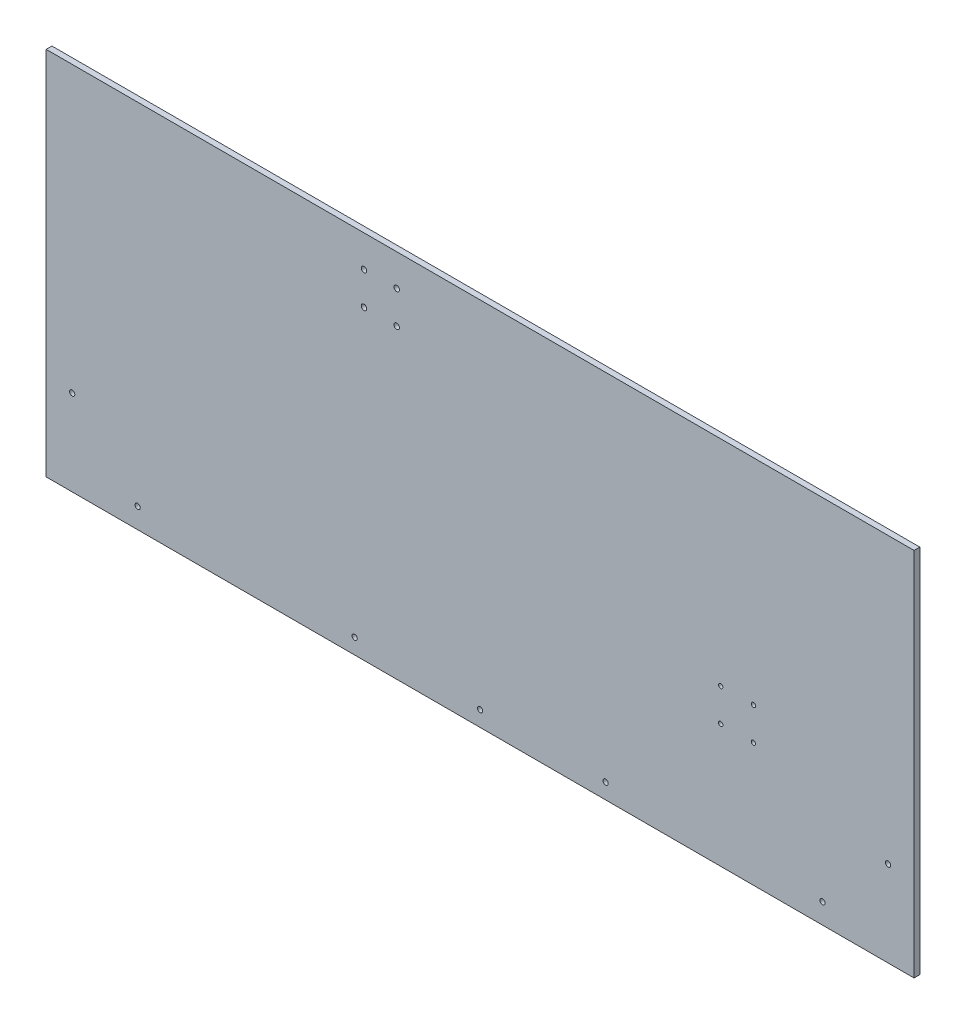
ISO-10303-21;
HEADER;
FILE_DESCRIPTION(('STEP AP214'),'2;1');
FILE_NAME('part.step','',(''),(''),'','','');
FILE_SCHEMA(('AUTOMOTIVE_DESIGN { 1 0 10303 214 1 1 1 1 }'));
ENDSEC;
DATA;
#1=APPLICATION_CONTEXT('core data for automotive mechanical design processes');
#2=APPLICATION_PROTOCOL_DEFINITION('international standard','automotive_design',2000,#1);
#3=PRODUCT_CONTEXT('',#1,'mechanical');
#4=PRODUCT('Part','Part','',(#3));
#5=PRODUCT_RELATED_PRODUCT_CATEGORY('part','',(#4));
#6=PRODUCT_DEFINITION_FORMATION('','',#4);
#7=PRODUCT_DEFINITION_CONTEXT('part definition',#1,'design');
#8=PRODUCT_DEFINITION('design','',#6,#7);
#9=PRODUCT_DEFINITION_SHAPE('','',#8);
#10=(LENGTH_UNIT() NAMED_UNIT(*) SI_UNIT(.MILLI.,.METRE.));
#11=(NAMED_UNIT(*) PLANE_ANGLE_UNIT() SI_UNIT($,.RADIAN.));
#12=(NAMED_UNIT(*) SI_UNIT($,.STERADIAN.) SOLID_ANGLE_UNIT());
#13=UNCERTAINTY_MEASURE_WITH_UNIT(LENGTH_MEASURE(1.E-05),#10,'distance_accuracy_value','');
#14=(GEOMETRIC_REPRESENTATION_CONTEXT(3) GLOBAL_UNCERTAINTY_ASSIGNED_CONTEXT((#13)) GLOBAL_UNIT_ASSIGNED_CONTEXT((#10,
#11,#12)) REPRESENTATION_CONTEXT('',''));
#15=CARTESIAN_POINT('',(0.,0.,0.));
#16=DIRECTION('',(0.,0.,1.));
#17=DIRECTION('',(1.,0.,0.));
#18=AXIS2_PLACEMENT_3D('',#15,#16,#17);
#19=CARTESIAN_POINT('',(357.1875,-152.4,4.7625));
#20=DIRECTION('',(-1.,0.,0.));
#21=DIRECTION('',(0.,0.,1.));
#22=AXIS2_PLACEMENT_3D('',#19,#20,#21);
#23=PLANE('',#22);
#24=DIRECTION('',(0.,1.,0.));
#25=VECTOR('',#24,1.);
#26=CARTESIAN_POINT('',(357.1875,-152.4,0.));
#27=LINE('',#26,#25);
#28=CARTESIAN_POINT('',(357.1875,-152.4,0.));
#29=VERTEX_POINT('',#28);
#30=CARTESIAN_POINT('',(357.1875,152.4,0.));
#31=VERTEX_POINT('',#30);
#32=EDGE_CURVE('E96',#29,#31,#27,.T.);
#33=ORIENTED_EDGE('',*,*,#32,.T.);
#34=DIRECTION('',(0.,0.,-1.));
#35=VECTOR('',#34,1.);
#36=CARTESIAN_POINT('',(357.1875,152.4,4.7625));
#37=LINE('',#36,#35);
#38=CARTESIAN_POINT('',(357.1875,152.4,4.7625));
#39=VERTEX_POINT('',#38);
#40=EDGE_CURVE('E11',#39,#31,#37,.T.);
#41=ORIENTED_EDGE('',*,*,#40,.F.);
#42=DIRECTION('',(0.,1.,0.));
#43=VECTOR('',#42,1.);
#44=CARTESIAN_POINT('',(357.1875,-152.4,4.7625));
#45=LINE('',#44,#43);
#46=CARTESIAN_POINT('',(357.1875,-152.4,4.7625));
#47=VERTEX_POINT('',#46);
#48=EDGE_CURVE('E84',#47,#39,#45,.T.);
#49=ORIENTED_EDGE('',*,*,#48,.F.);
#50=DIRECTION('',(0.,0.,-1.));
#51=VECTOR('',#50,1.);
#52=CARTESIAN_POINT('',(357.1875,-152.4,4.7625));
#53=LINE('',#52,#51);
#54=EDGE_CURVE('E92',#47,#29,#53,.T.);
#55=ORIENTED_EDGE('',*,*,#54,.T.);
#56=EDGE_LOOP('',(#33,#41,#49,#55));
#57=FACE_BOUND('',#56,.T.);
#58=ADVANCED_FACE('F33',(#57),#23,.F.);
#59=CARTESIAN_POINT('',(-357.1875,152.4,4.7625));
#60=DIRECTION('',(0.,-1.,0.));
#61=DIRECTION('',(0.,0.,-1.));
#62=AXIS2_PLACEMENT_3D('',#59,#60,#61);
#63=PLANE('',#62);
#64=DIRECTION('',(-1.,0.,0.));
#65=VECTOR('',#64,1.);
#66=CARTESIAN_POINT('',(-357.1875,152.4,0.));
#67=LINE('',#66,#65);
#68=CARTESIAN_POINT('',(-357.1875,152.4,0.));
#69=VERTEX_POINT('',#68);
#70=EDGE_CURVE('E88',#31,#69,#67,.T.);
#71=ORIENTED_EDGE('',*,*,#70,.T.);
#72=DIRECTION('',(0.,0.,-1.));
#73=VECTOR('',#72,1.);
#74=CARTESIAN_POINT('',(-357.1875,152.4,4.7625));
#75=LINE('',#74,#73);
#76=CARTESIAN_POINT('',(-357.1875,152.4,4.7625));
#77=VERTEX_POINT('',#76);
#78=EDGE_CURVE('E41',#77,#69,#75,.T.);
#79=ORIENTED_EDGE('',*,*,#78,.F.);
#80=DIRECTION('',(-1.,0.,0.));
#81=VECTOR('',#80,1.);
#82=CARTESIAN_POINT('',(-357.1875,152.4,4.7625));
#83=LINE('',#82,#81);
#84=EDGE_CURVE('E79',#39,#77,#83,.T.);
#85=ORIENTED_EDGE('',*,*,#84,.F.);
#86=ORIENTED_EDGE('',*,*,#40,.T.);
#87=EDGE_LOOP('',(#71,#79,#85,#86));
#88=FACE_BOUND('',#87,.T.);
#89=ADVANCED_FACE('F87',(#88),#63,.F.);
#90=CARTESIAN_POINT('',(-357.1875,-152.4,4.7625));
#91=DIRECTION('',(1.,0.,0.));
#92=DIRECTION('',(0.,0.,-1.));
#93=AXIS2_PLACEMENT_3D('',#90,#91,#92);
#94=PLANE('',#93);
#95=DIRECTION('',(0.,-1.,0.));
#96=VECTOR('',#95,1.);
#97=CARTESIAN_POINT('',(-357.1875,-152.4,0.));
#98=LINE('',#97,#96);
#99=CARTESIAN_POINT('',(-357.1875,-152.4,0.));
#100=VERTEX_POINT('',#99);
#101=EDGE_CURVE('E66',#69,#100,#98,.T.);
#102=ORIENTED_EDGE('',*,*,#101,.T.);
#103=DIRECTION('',(0.,0.,-1.));
#104=VECTOR('',#103,1.);
#105=CARTESIAN_POINT('',(-357.1875,-152.4,4.7625));
#106=LINE('',#105,#104);
#107=CARTESIAN_POINT('',(-357.1875,-152.4,4.7625));
#108=VERTEX_POINT('',#107);
#109=EDGE_CURVE('E89',#108,#100,#106,.T.);
#110=ORIENTED_EDGE('',*,*,#109,.F.);
#111=DIRECTION('',(0.,-1.,0.));
#112=VECTOR('',#111,1.);
#113=CARTESIAN_POINT('',(-357.1875,-152.4,4.7625));
#114=LINE('',#113,#112);
#115=EDGE_CURVE('E82',#77,#108,#114,.T.);
#116=ORIENTED_EDGE('',*,*,#115,.F.);
#117=ORIENTED_EDGE('',*,*,#78,.T.);
#118=EDGE_LOOP('',(#102,#110,#116,#117));
#119=FACE_BOUND('',#118,.T.);
#120=ADVANCED_FACE('F90',(#119),#94,.F.);
#121=CARTESIAN_POINT('',(-357.1875,-152.4,4.7625));
#122=DIRECTION('',(0.,1.,0.));
#123=DIRECTION('',(0.,0.,1.));
#124=AXIS2_PLACEMENT_3D('',#121,#122,#123);
#125=PLANE('',#124);
#126=DIRECTION('',(1.,0.,0.));
#127=VECTOR('',#126,1.);
#128=CARTESIAN_POINT('',(-357.1875,-152.4,0.));
#129=LINE('',#128,#127);
#130=EDGE_CURVE('E72',#100,#29,#129,.T.);
#131=ORIENTED_EDGE('',*,*,#130,.T.);
#132=ORIENTED_EDGE('',*,*,#54,.F.);
#133=DIRECTION('',(1.,0.,0.));
#134=VECTOR('',#133,1.);
#135=CARTESIAN_POINT('',(-357.1875,-152.4,4.7625));
#136=LINE('',#135,#134);
#137=EDGE_CURVE('E49',#108,#47,#136,.T.);
#138=ORIENTED_EDGE('',*,*,#137,.F.);
#139=ORIENTED_EDGE('',*,*,#109,.T.);
#140=EDGE_LOOP('',(#131,#132,#138,#139));
#141=FACE_BOUND('',#140,.T.);
#142=ADVANCED_FACE('F104',(#141),#125,.F.);
#143=CARTESIAN_POINT('',(0.,0.,4.7625));
#144=DIRECTION('',(0.,0.,-1.));
#145=DIRECTION('',(-1.,0.,0.));
#146=AXIS2_PLACEMENT_3D('',#143,#144,#145);
#147=PLANE('',#146);
#148=CARTESIAN_POINT('',(198.048115818396,-50.8083841816038,4.7625));
#149=DIRECTION('',(0.,0.,1.));
#150=DIRECTION('',(1.,0.,0.));
#151=AXIS2_PLACEMENT_3D('',#148,#149,#150);
#152=CIRCLE('',#151,1.77799999999998);
#153=CARTESIAN_POINT('',(199.826115818396,-50.8083841816038,4.7625));
#154=VERTEX_POINT('',#153);
#155=EDGE_CURVE('E194',#154,#154,#152,.T.);
#156=ORIENTED_EDGE('',*,*,#155,.F.);
#157=EDGE_LOOP('',(#156));
#158=FACE_BOUND('',#157,.T.);
#159=CARTESIAN_POINT('',(224.988884181604,-50.8083841816037,4.7625));
#160=DIRECTION('',(0.,0.,1.));
#161=DIRECTION('',(1.,0.,0.));
#162=AXIS2_PLACEMENT_3D('',#159,#160,#161);
#163=CIRCLE('',#162,1.77800000000001);
#164=CARTESIAN_POINT('',(226.766884181604,-50.8083841816037,4.7625));
#165=VERTEX_POINT('',#164);
#166=EDGE_CURVE('E188',#165,#165,#163,.T.);
#167=ORIENTED_EDGE('',*,*,#166,.F.);
#168=EDGE_LOOP('',(#167));
#169=FACE_BOUND('',#168,.T.);
#170=CARTESIAN_POINT('',(224.988884181604,-23.8676158183963,4.7625));
#171=DIRECTION('',(0.,0.,1.));
#172=DIRECTION('',(1.,0.,0.));
#173=AXIS2_PLACEMENT_3D('',#170,#171,#172);
#174=CIRCLE('',#173,1.77800000000001);
#175=CARTESIAN_POINT('',(226.766884181604,-23.8676158183963,4.7625));
#176=VERTEX_POINT('',#175);
#177=EDGE_CURVE('E182',#176,#176,#174,.T.);
#178=ORIENTED_EDGE('',*,*,#177,.F.);
#179=EDGE_LOOP('',(#178));
#180=FACE_BOUND('',#179,.T.);
#181=CARTESIAN_POINT('',(198.048115818396,-23.8676158183965,4.7625));
#182=DIRECTION('',(0.,0.,1.));
#183=DIRECTION('',(1.,0.,0.));
#184=AXIS2_PLACEMENT_3D('',#181,#182,#183);
#185=CIRCLE('',#184,1.77799999999998);
#186=CARTESIAN_POINT('',(199.826115818396,-23.8676158183965,4.7625));
#187=VERTEX_POINT('',#186);
#188=EDGE_CURVE('E176',#187,#187,#185,.T.);
#189=ORIENTED_EDGE('',*,*,#188,.F.);
#190=EDGE_LOOP('',(#189));
#191=FACE_BOUND('',#190,.T.);
#192=CARTESIAN_POINT('',(-95.5675000000001,126.238,4.7625));
#193=DIRECTION('',(0.,0.,1.));
#194=DIRECTION('',(1.,0.,0.));
#195=AXIS2_PLACEMENT_3D('',#192,#193,#194);
#196=CIRCLE('',#195,2.2479);
#197=CARTESIAN_POINT('',(-93.3196000000001,126.238,4.7625));
#198=VERTEX_POINT('',#197);
#199=EDGE_CURVE('E172',#198,#198,#196,.T.);
#200=ORIENTED_EDGE('',*,*,#199,.F.);
#201=EDGE_LOOP('',(#200));
#202=FACE_BOUND('',#201,.T.);
#203=CARTESIAN_POINT('',(-68.6435000000001,126.238,4.7625));
#204=DIRECTION('',(0.,0.,1.));
#205=DIRECTION('',(1.,0.,0.));
#206=AXIS2_PLACEMENT_3D('',#203,#204,#205);
#207=CIRCLE('',#206,2.2479);
#208=CARTESIAN_POINT('',(-66.3956000000001,126.238,4.7625));
#209=VERTEX_POINT('',#208);
#210=EDGE_CURVE('E166',#209,#209,#207,.T.);
#211=ORIENTED_EDGE('',*,*,#210,.F.);
#212=EDGE_LOOP('',(#211));
#213=FACE_BOUND('',#212,.T.);
#214=CARTESIAN_POINT('',(-95.5675000000001,99.314,4.7625));
#215=DIRECTION('',(0.,0.,1.));
#216=DIRECTION('',(1.,0.,0.));
#217=AXIS2_PLACEMENT_3D('',#214,#215,#216);
#218=CIRCLE('',#217,2.2479);
#219=CARTESIAN_POINT('',(-93.3196000000001,99.314,4.7625));
#220=VERTEX_POINT('',#219);
#221=EDGE_CURVE('E160',#220,#220,#218,.T.);
#222=ORIENTED_EDGE('',*,*,#221,.F.);
#223=EDGE_LOOP('',(#222));
#224=FACE_BOUND('',#223,.T.);
#225=CARTESIAN_POINT('',(-68.6435000000001,99.314,4.7625));
#226=DIRECTION('',(0.,0.,1.));
#227=DIRECTION('',(1.,0.,0.));
#228=AXIS2_PLACEMENT_3D('',#225,#226,#227);
#229=CIRCLE('',#228,2.2479);
#230=CARTESIAN_POINT('',(-66.3956000000001,99.314,4.7625));
#231=VERTEX_POINT('',#230);
#232=EDGE_CURVE('E154',#231,#231,#229,.T.);
#233=ORIENTED_EDGE('',*,*,#232,.F.);
#234=EDGE_LOOP('',(#233));
#235=FACE_BOUND('',#234,.T.);
#236=CARTESIAN_POINT('',(-103.251,-139.7,4.7625));
#237=DIRECTION('',(0.,0.,1.));
#238=DIRECTION('',(1.,0.,0.));
#239=AXIS2_PLACEMENT_3D('',#236,#237,#238);
#240=CIRCLE('',#239,2.15264999999999);
#241=CARTESIAN_POINT('',(-101.09835,-139.7,4.7625));
#242=VERTEX_POINT('',#241);
#243=EDGE_CURVE('E148',#242,#242,#240,.T.);
#244=ORIENTED_EDGE('',*,*,#243,.F.);
#245=EDGE_LOOP('',(#244));
#246=FACE_BOUND('',#245,.T.);
#247=CARTESIAN_POINT('',(0.,-139.7,4.7625));
#248=DIRECTION('',(0.,0.,1.));
#249=DIRECTION('',(1.,0.,0.));
#250=AXIS2_PLACEMENT_3D('',#247,#248,#249);
#251=CIRCLE('',#250,2.15264999999999);
#252=CARTESIAN_POINT('',(2.15264999999999,-139.7,4.7625));
#253=VERTEX_POINT('',#252);
#254=EDGE_CURVE('E142',#253,#253,#251,.T.);
#255=ORIENTED_EDGE('',*,*,#254,.F.);
#256=EDGE_LOOP('',(#255));
#257=FACE_BOUND('',#256,.T.);
#258=CARTESIAN_POINT('',(103.251,-139.7,4.7625));
#259=DIRECTION('',(0.,0.,1.));
#260=DIRECTION('',(1.,0.,0.));
#261=AXIS2_PLACEMENT_3D('',#258,#259,#260);
#262=CIRCLE('',#261,2.15264999999999);
#263=CARTESIAN_POINT('',(105.40365,-139.7,4.7625));
#264=VERTEX_POINT('',#263);
#265=EDGE_CURVE('E136',#264,#264,#262,.T.);
#266=ORIENTED_EDGE('',*,*,#265,.F.);
#267=EDGE_LOOP('',(#266));
#268=FACE_BOUND('',#267,.T.);
#269=CARTESIAN_POINT('',(-335.768024484277,-81.8614877578616,4.7625));
#270=DIRECTION('',(0.,0.,1.));
#271=DIRECTION('',(1.,0.,0.));
#272=AXIS2_PLACEMENT_3D('',#269,#270,#271);
#273=CIRCLE('',#272,2.15264999999998);
#274=CARTESIAN_POINT('',(-333.615374484277,-81.8614877578616,4.7625));
#275=VERTEX_POINT('',#274);
#276=EDGE_CURVE('E130',#275,#275,#273,.T.);
#277=ORIENTED_EDGE('',*,*,#276,.F.);
#278=EDGE_LOOP('',(#277));
#279=FACE_BOUND('',#278,.T.);
#280=CARTESIAN_POINT('',(-281.886487757862,-135.743024484277,4.7625));
#281=DIRECTION('',(0.,0.,1.));
#282=DIRECTION('',(1.,0.,0.));
#283=AXIS2_PLACEMENT_3D('',#280,#281,#282);
#284=CIRCLE('',#283,2.15264999999998);
#285=CARTESIAN_POINT('',(-279.733837757862,-135.743024484277,4.7625));
#286=VERTEX_POINT('',#285);
#287=EDGE_CURVE('E124',#286,#286,#284,.T.);
#288=ORIENTED_EDGE('',*,*,#287,.F.);
#289=EDGE_LOOP('',(#288));
#290=FACE_BOUND('',#289,.T.);
#291=CARTESIAN_POINT('',(281.886487757862,-135.743024484277,4.7625));
#292=DIRECTION('',(0.,0.,1.));
#293=DIRECTION('',(1.,0.,0.));
#294=AXIS2_PLACEMENT_3D('',#291,#292,#293);
#295=CIRCLE('',#294,2.15264999999998);
#296=CARTESIAN_POINT('',(284.039137757862,-135.743024484277,4.7625));
#297=VERTEX_POINT('',#296);
#298=EDGE_CURVE('E118',#297,#297,#295,.T.);
#299=ORIENTED_EDGE('',*,*,#298,.F.);
#300=EDGE_LOOP('',(#299));
#301=FACE_BOUND('',#300,.T.);
#302=CARTESIAN_POINT('',(335.768024484276,-81.8614877578616,4.7625));
#303=DIRECTION('',(0.,0.,1.));
#304=DIRECTION('',(1.,0.,0.));
#305=AXIS2_PLACEMENT_3D('',#302,#303,#304);
#306=CIRCLE('',#305,2.15264999999998);
#307=CARTESIAN_POINT('',(337.920674484276,-81.8614877578616,4.7625));
#308=VERTEX_POINT('',#307);
#309=EDGE_CURVE('E112',#308,#308,#306,.T.);
#310=ORIENTED_EDGE('',*,*,#309,.F.);
#311=EDGE_LOOP('',(#310));
#312=FACE_BOUND('',#311,.T.);
#313=ORIENTED_EDGE('',*,*,#48,.T.);
#314=ORIENTED_EDGE('',*,*,#84,.T.);
#315=ORIENTED_EDGE('',*,*,#115,.T.);
#316=ORIENTED_EDGE('',*,*,#137,.T.);
#317=EDGE_LOOP('',(#313,#314,#315,#316));
#318=FACE_BOUND('',#317,.T.);
#319=ADVANCED_FACE('F80',(#158,#169,#180,#191,#202,#213,#224,#235,#246,#257,#268,#279,#290,#301,
#312,#318),#147,.F.);
#320=CARTESIAN_POINT('',(0.,0.,0.));
#321=DIRECTION('',(0.,0.,-1.));
#322=DIRECTION('',(-1.,0.,0.));
#323=AXIS2_PLACEMENT_3D('',#320,#321,#322);
#324=PLANE('',#323);
#325=CARTESIAN_POINT('',(198.048115818396,-50.8083841816038,0.));
#326=DIRECTION('',(0.,0.,1.));
#327=DIRECTION('',(1.,0.,0.));
#328=AXIS2_PLACEMENT_3D('',#325,#326,#327);
#329=CIRCLE('',#328,1.77799999999998);
#330=CARTESIAN_POINT('',(199.826115818396,-50.8083841816038,0.));
#331=VERTEX_POINT('',#330);
#332=EDGE_CURVE('E191',#331,#331,#329,.T.);
#333=ORIENTED_EDGE('',*,*,#332,.T.);
#334=EDGE_LOOP('',(#333));
#335=FACE_BOUND('',#334,.T.);
#336=CARTESIAN_POINT('',(224.988884181604,-50.8083841816037,0.));
#337=DIRECTION('',(0.,0.,1.));
#338=DIRECTION('',(1.,0.,0.));
#339=AXIS2_PLACEMENT_3D('',#336,#337,#338);
#340=CIRCLE('',#339,1.77800000000001);
#341=CARTESIAN_POINT('',(226.766884181604,-50.8083841816037,0.));
#342=VERTEX_POINT('',#341);
#343=EDGE_CURVE('E185',#342,#342,#340,.T.);
#344=ORIENTED_EDGE('',*,*,#343,.T.);
#345=EDGE_LOOP('',(#344));
#346=FACE_BOUND('',#345,.T.);
#347=CARTESIAN_POINT('',(224.988884181604,-23.8676158183963,0.));
#348=DIRECTION('',(0.,0.,1.));
#349=DIRECTION('',(1.,0.,0.));
#350=AXIS2_PLACEMENT_3D('',#347,#348,#349);
#351=CIRCLE('',#350,1.77800000000001);
#352=CARTESIAN_POINT('',(226.766884181604,-23.8676158183963,0.));
#353=VERTEX_POINT('',#352);
#354=EDGE_CURVE('E179',#353,#353,#351,.T.);
#355=ORIENTED_EDGE('',*,*,#354,.T.);
#356=EDGE_LOOP('',(#355));
#357=FACE_BOUND('',#356,.T.);
#358=CARTESIAN_POINT('',(198.048115818396,-23.8676158183965,0.));
#359=DIRECTION('',(0.,0.,1.));
#360=DIRECTION('',(1.,0.,0.));
#361=AXIS2_PLACEMENT_3D('',#358,#359,#360);
#362=CIRCLE('',#361,1.77799999999998);
#363=CARTESIAN_POINT('',(199.826115818396,-23.8676158183965,0.));
#364=VERTEX_POINT('',#363);
#365=EDGE_CURVE('E175',#364,#364,#362,.T.);
#366=ORIENTED_EDGE('',*,*,#365,.T.);
#367=EDGE_LOOP('',(#366));
#368=FACE_BOUND('',#367,.T.);
#369=CARTESIAN_POINT('',(-95.5675000000001,126.238,0.));
#370=DIRECTION('',(0.,0.,-1.));
#371=DIRECTION('',(-1.,0.,0.));
#372=AXIS2_PLACEMENT_3D('',#369,#370,#371);
#373=CIRCLE('',#372,2.24789999999999);
#374=CARTESIAN_POINT('',(-97.8154000000001,126.238,0.));
#375=VERTEX_POINT('',#374);
#376=EDGE_CURVE('E169',#375,#375,#373,.T.);
#377=ORIENTED_EDGE('',*,*,#376,.F.);
#378=EDGE_LOOP('',(#377));
#379=FACE_BOUND('',#378,.T.);
#380=CARTESIAN_POINT('',(-68.6435000000001,126.238,0.));
#381=DIRECTION('',(0.,0.,-1.));
#382=DIRECTION('',(-1.,0.,0.));
#383=AXIS2_PLACEMENT_3D('',#380,#381,#382);
#384=CIRCLE('',#383,2.24789999999999);
#385=CARTESIAN_POINT('',(-70.8914000000001,126.238,0.));
#386=VERTEX_POINT('',#385);
#387=EDGE_CURVE('E163',#386,#386,#384,.T.);
#388=ORIENTED_EDGE('',*,*,#387,.F.);
#389=EDGE_LOOP('',(#388));
#390=FACE_BOUND('',#389,.T.);
#391=CARTESIAN_POINT('',(-95.5675000000001,99.314,0.));
#392=DIRECTION('',(0.,0.,-1.));
#393=DIRECTION('',(-1.,0.,0.));
#394=AXIS2_PLACEMENT_3D('',#391,#392,#393);
#395=CIRCLE('',#394,2.24789999999999);
#396=CARTESIAN_POINT('',(-97.8154000000001,99.314,0.));
#397=VERTEX_POINT('',#396);
#398=EDGE_CURVE('E157',#397,#397,#395,.T.);
#399=ORIENTED_EDGE('',*,*,#398,.F.);
#400=EDGE_LOOP('',(#399));
#401=FACE_BOUND('',#400,.T.);
#402=CARTESIAN_POINT('',(-68.6435000000001,99.314,0.));
#403=DIRECTION('',(0.,0.,-1.));
#404=DIRECTION('',(-1.,0.,0.));
#405=AXIS2_PLACEMENT_3D('',#402,#403,#404);
#406=CIRCLE('',#405,2.24789999999999);
#407=CARTESIAN_POINT('',(-70.8914000000001,99.314,0.));
#408=VERTEX_POINT('',#407);
#409=EDGE_CURVE('E151',#408,#408,#406,.T.);
#410=ORIENTED_EDGE('',*,*,#409,.F.);
#411=EDGE_LOOP('',(#410));
#412=FACE_BOUND('',#411,.T.);
#413=CARTESIAN_POINT('',(-103.251,-139.7,0.));
#414=DIRECTION('',(0.,0.,-1.));
#415=DIRECTION('',(-1.,0.,0.));
#416=AXIS2_PLACEMENT_3D('',#413,#414,#415);
#417=CIRCLE('',#416,2.15264999999999);
#418=CARTESIAN_POINT('',(-105.40365,-139.7,0.));
#419=VERTEX_POINT('',#418);
#420=EDGE_CURVE('E145',#419,#419,#417,.T.);
#421=ORIENTED_EDGE('',*,*,#420,.F.);
#422=EDGE_LOOP('',(#421));
#423=FACE_BOUND('',#422,.T.);
#424=CARTESIAN_POINT('',(0.,-139.7,0.));
#425=DIRECTION('',(0.,0.,-1.));
#426=DIRECTION('',(-1.,0.,0.));
#427=AXIS2_PLACEMENT_3D('',#424,#425,#426);
#428=CIRCLE('',#427,2.15264999999999);
#429=CARTESIAN_POINT('',(-2.15264999999999,-139.7,0.));
#430=VERTEX_POINT('',#429);
#431=EDGE_CURVE('E139',#430,#430,#428,.T.);
#432=ORIENTED_EDGE('',*,*,#431,.F.);
#433=EDGE_LOOP('',(#432));
#434=FACE_BOUND('',#433,.T.);
#435=CARTESIAN_POINT('',(103.251,-139.7,0.));
#436=DIRECTION('',(0.,0.,-1.));
#437=DIRECTION('',(-1.,0.,0.));
#438=AXIS2_PLACEMENT_3D('',#435,#436,#437);
#439=CIRCLE('',#438,2.15264999999999);
#440=CARTESIAN_POINT('',(101.09835,-139.7,0.));
#441=VERTEX_POINT('',#440);
#442=EDGE_CURVE('E133',#441,#441,#439,.T.);
#443=ORIENTED_EDGE('',*,*,#442,.F.);
#444=EDGE_LOOP('',(#443));
#445=FACE_BOUND('',#444,.T.);
#446=CARTESIAN_POINT('',(-335.768024484277,-81.8614877578616,0.));
#447=DIRECTION('',(0.,0.,-1.));
#448=DIRECTION('',(-1.,0.,0.));
#449=AXIS2_PLACEMENT_3D('',#446,#447,#448);
#450=CIRCLE('',#449,2.15264999999998);
#451=CARTESIAN_POINT('',(-337.920674484277,-81.8614877578616,0.));
#452=VERTEX_POINT('',#451);
#453=EDGE_CURVE('E127',#452,#452,#450,.T.);
#454=ORIENTED_EDGE('',*,*,#453,.F.);
#455=EDGE_LOOP('',(#454));
#456=FACE_BOUND('',#455,.T.);
#457=CARTESIAN_POINT('',(-281.886487757862,-135.743024484277,0.));
#458=DIRECTION('',(0.,0.,-1.));
#459=DIRECTION('',(-1.,0.,0.));
#460=AXIS2_PLACEMENT_3D('',#457,#458,#459);
#461=CIRCLE('',#460,2.15264999999998);
#462=CARTESIAN_POINT('',(-284.039137757862,-135.743024484277,0.));
#463=VERTEX_POINT('',#462);
#464=EDGE_CURVE('E121',#463,#463,#461,.T.);
#465=ORIENTED_EDGE('',*,*,#464,.F.);
#466=EDGE_LOOP('',(#465));
#467=FACE_BOUND('',#466,.T.);
#468=CARTESIAN_POINT('',(281.886487757862,-135.743024484277,0.));
#469=DIRECTION('',(0.,0.,-1.));
#470=DIRECTION('',(-1.,0.,0.));
#471=AXIS2_PLACEMENT_3D('',#468,#469,#470);
#472=CIRCLE('',#471,2.15264999999998);
#473=CARTESIAN_POINT('',(279.733837757862,-135.743024484277,0.));
#474=VERTEX_POINT('',#473);
#475=EDGE_CURVE('E115',#474,#474,#472,.T.);
#476=ORIENTED_EDGE('',*,*,#475,.F.);
#477=EDGE_LOOP('',(#476));
#478=FACE_BOUND('',#477,.T.);
#479=CARTESIAN_POINT('',(335.768024484276,-81.8614877578616,0.));
#480=DIRECTION('',(0.,0.,-1.));
#481=DIRECTION('',(-1.,0.,0.));
#482=AXIS2_PLACEMENT_3D('',#479,#480,#481);
#483=CIRCLE('',#482,2.15264999999998);
#484=CARTESIAN_POINT('',(333.615374484276,-81.8614877578616,0.));
#485=VERTEX_POINT('',#484);
#486=EDGE_CURVE('E99',#485,#485,#483,.T.);
#487=ORIENTED_EDGE('',*,*,#486,.F.);
#488=EDGE_LOOP('',(#487));
#489=FACE_BOUND('',#488,.T.);
#490=ORIENTED_EDGE('',*,*,#32,.F.);
#491=ORIENTED_EDGE('',*,*,#130,.F.);
#492=ORIENTED_EDGE('',*,*,#101,.F.);
#493=ORIENTED_EDGE('',*,*,#70,.F.);
#494=EDGE_LOOP('',(#490,#491,#492,#493));
#495=FACE_BOUND('',#494,.T.);
#496=ADVANCED_FACE('F107',(#335,#346,#357,#368,#379,#390,#401,#412,#423,#434,#445,#456,#467,
#478,#489,#495),#324,.T.);
#497=CARTESIAN_POINT('',(335.768024484276,-81.8614877578616,4.7625));
#498=DIRECTION('',(0.,0.,1.));
#499=DIRECTION('',(1.,0.,0.));
#500=AXIS2_PLACEMENT_3D('',#497,#498,#499);
#501=CYLINDRICAL_SURFACE('',#500,2.15264999999998);
#502=ORIENTED_EDGE('',*,*,#486,.T.);
#503=EDGE_LOOP('',(#502));
#504=FACE_BOUND('',#503,.T.);
#505=ORIENTED_EDGE('',*,*,#309,.T.);
#506=EDGE_LOOP('',(#505));
#507=FACE_BOUND('',#506,.T.);
#508=ADVANCED_FACE('F240',(#504,#507),#501,.F.);
#509=CARTESIAN_POINT('',(281.886487757862,-135.743024484277,4.7625));
#510=DIRECTION('',(0.,0.,1.));
#511=DIRECTION('',(1.,0.,0.));
#512=AXIS2_PLACEMENT_3D('',#509,#510,#511);
#513=CYLINDRICAL_SURFACE('',#512,2.15264999999998);
#514=ORIENTED_EDGE('',*,*,#475,.T.);
#515=EDGE_LOOP('',(#514));
#516=FACE_BOUND('',#515,.T.);
#517=ORIENTED_EDGE('',*,*,#298,.T.);
#518=EDGE_LOOP('',(#517));
#519=FACE_BOUND('',#518,.T.);
#520=ADVANCED_FACE('F242',(#516,#519),#513,.F.);
#521=CARTESIAN_POINT('',(-281.886487757862,-135.743024484277,4.7625));
#522=DIRECTION('',(0.,0.,1.));
#523=DIRECTION('',(1.,0.,0.));
#524=AXIS2_PLACEMENT_3D('',#521,#522,#523);
#525=CYLINDRICAL_SURFACE('',#524,2.15264999999998);
#526=ORIENTED_EDGE('',*,*,#464,.T.);
#527=EDGE_LOOP('',(#526));
#528=FACE_BOUND('',#527,.T.);
#529=ORIENTED_EDGE('',*,*,#287,.T.);
#530=EDGE_LOOP('',(#529));
#531=FACE_BOUND('',#530,.T.);
#532=ADVANCED_FACE('F249',(#528,#531),#525,.F.);
#533=CARTESIAN_POINT('',(-335.768024484277,-81.8614877578616,4.7625));
#534=DIRECTION('',(0.,0.,1.));
#535=DIRECTION('',(1.,0.,0.));
#536=AXIS2_PLACEMENT_3D('',#533,#534,#535);
#537=CYLINDRICAL_SURFACE('',#536,2.15264999999998);
#538=ORIENTED_EDGE('',*,*,#453,.T.);
#539=EDGE_LOOP('',(#538));
#540=FACE_BOUND('',#539,.T.);
#541=ORIENTED_EDGE('',*,*,#276,.T.);
#542=EDGE_LOOP('',(#541));
#543=FACE_BOUND('',#542,.T.);
#544=ADVANCED_FACE('F348',(#540,#543),#537,.F.);
#545=CARTESIAN_POINT('',(103.251,-139.7,4.7625));
#546=DIRECTION('',(0.,0.,1.));
#547=DIRECTION('',(1.,0.,0.));
#548=AXIS2_PLACEMENT_3D('',#545,#546,#547);
#549=CYLINDRICAL_SURFACE('',#548,2.15264999999999);
#550=ORIENTED_EDGE('',*,*,#442,.T.);
#551=EDGE_LOOP('',(#550));
#552=FACE_BOUND('',#551,.T.);
#553=ORIENTED_EDGE('',*,*,#265,.T.);
#554=EDGE_LOOP('',(#553));
#555=FACE_BOUND('',#554,.T.);
#556=ADVANCED_FACE('F344',(#552,#555),#549,.F.);
#557=CARTESIAN_POINT('',(0.,-139.7,4.7625));
#558=DIRECTION('',(0.,0.,1.));
#559=DIRECTION('',(1.,0.,0.));
#560=AXIS2_PLACEMENT_3D('',#557,#558,#559);
#561=CYLINDRICAL_SURFACE('',#560,2.15264999999999);
#562=ORIENTED_EDGE('',*,*,#431,.T.);
#563=EDGE_LOOP('',(#562));
#564=FACE_BOUND('',#563,.T.);
#565=ORIENTED_EDGE('',*,*,#254,.T.);
#566=EDGE_LOOP('',(#565));
#567=FACE_BOUND('',#566,.T.);
#568=ADVANCED_FACE('F340',(#564,#567),#561,.F.);
#569=CARTESIAN_POINT('',(-103.251,-139.7,4.7625));
#570=DIRECTION('',(0.,0.,1.));
#571=DIRECTION('',(1.,0.,0.));
#572=AXIS2_PLACEMENT_3D('',#569,#570,#571);
#573=CYLINDRICAL_SURFACE('',#572,2.15264999999999);
#574=ORIENTED_EDGE('',*,*,#420,.T.);
#575=EDGE_LOOP('',(#574));
#576=FACE_BOUND('',#575,.T.);
#577=ORIENTED_EDGE('',*,*,#243,.T.);
#578=EDGE_LOOP('',(#577));
#579=FACE_BOUND('',#578,.T.);
#580=ADVANCED_FACE('F336',(#576,#579),#573,.F.);
#581=CARTESIAN_POINT('',(-68.6435000000001,99.314,4.7625));
#582=DIRECTION('',(0.,0.,1.));
#583=DIRECTION('',(1.,0.,0.));
#584=AXIS2_PLACEMENT_3D('',#581,#582,#583);
#585=CYLINDRICAL_SURFACE('',#584,2.24789999999999);
#586=ORIENTED_EDGE('',*,*,#409,.T.);
#587=EDGE_LOOP('',(#586));
#588=FACE_BOUND('',#587,.T.);
#589=ORIENTED_EDGE('',*,*,#232,.T.);
#590=EDGE_LOOP('',(#589));
#591=FACE_BOUND('',#590,.T.);
#592=ADVANCED_FACE('F332',(#588,#591),#585,.F.);
#593=CARTESIAN_POINT('',(-95.5675000000001,99.314,4.7625));
#594=DIRECTION('',(0.,0.,1.));
#595=DIRECTION('',(1.,0.,0.));
#596=AXIS2_PLACEMENT_3D('',#593,#594,#595);
#597=CYLINDRICAL_SURFACE('',#596,2.24789999999999);
#598=ORIENTED_EDGE('',*,*,#398,.T.);
#599=EDGE_LOOP('',(#598));
#600=FACE_BOUND('',#599,.T.);
#601=ORIENTED_EDGE('',*,*,#221,.T.);
#602=EDGE_LOOP('',(#601));
#603=FACE_BOUND('',#602,.T.);
#604=ADVANCED_FACE('F328',(#600,#603),#597,.F.);
#605=CARTESIAN_POINT('',(-68.6435000000001,126.238,4.7625));
#606=DIRECTION('',(0.,0.,1.));
#607=DIRECTION('',(1.,0.,0.));
#608=AXIS2_PLACEMENT_3D('',#605,#606,#607);
#609=CYLINDRICAL_SURFACE('',#608,2.24789999999999);
#610=ORIENTED_EDGE('',*,*,#387,.T.);
#611=EDGE_LOOP('',(#610));
#612=FACE_BOUND('',#611,.T.);
#613=ORIENTED_EDGE('',*,*,#210,.T.);
#614=EDGE_LOOP('',(#613));
#615=FACE_BOUND('',#614,.T.);
#616=ADVANCED_FACE('F324',(#612,#615),#609,.F.);
#617=CARTESIAN_POINT('',(-95.5675000000001,126.238,4.7625));
#618=DIRECTION('',(0.,0.,1.));
#619=DIRECTION('',(1.,0.,0.));
#620=AXIS2_PLACEMENT_3D('',#617,#618,#619);
#621=CYLINDRICAL_SURFACE('',#620,2.24789999999999);
#622=ORIENTED_EDGE('',*,*,#376,.T.);
#623=EDGE_LOOP('',(#622));
#624=FACE_BOUND('',#623,.T.);
#625=ORIENTED_EDGE('',*,*,#199,.T.);
#626=EDGE_LOOP('',(#625));
#627=FACE_BOUND('',#626,.T.);
#628=ADVANCED_FACE('F289',(#624,#627),#621,.F.);
#629=CARTESIAN_POINT('',(198.048115818396,-23.8676158183965,0.));
#630=DIRECTION('',(0.,0.,1.));
#631=DIRECTION('',(1.,0.,0.));
#632=AXIS2_PLACEMENT_3D('',#629,#630,#631);
#633=CYLINDRICAL_SURFACE('',#632,1.77799999999998);
#634=ORIENTED_EDGE('',*,*,#365,.F.);
#635=EDGE_LOOP('',(#634));
#636=FACE_BOUND('',#635,.T.);
#637=ORIENTED_EDGE('',*,*,#188,.T.);
#638=EDGE_LOOP('',(#637));
#639=FACE_BOUND('',#638,.T.);
#640=ADVANCED_FACE('F283',(#636,#639),#633,.F.);
#641=CARTESIAN_POINT('',(224.988884181604,-23.8676158183963,0.));
#642=DIRECTION('',(0.,0.,1.));
#643=DIRECTION('',(1.,0.,0.));
#644=AXIS2_PLACEMENT_3D('',#641,#642,#643);
#645=CYLINDRICAL_SURFACE('',#644,1.77800000000001);
#646=ORIENTED_EDGE('',*,*,#354,.F.);
#647=EDGE_LOOP('',(#646));
#648=FACE_BOUND('',#647,.T.);
#649=ORIENTED_EDGE('',*,*,#177,.T.);
#650=EDGE_LOOP('',(#649));
#651=FACE_BOUND('',#650,.T.);
#652=ADVANCED_FACE('F288',(#648,#651),#645,.F.);
#653=CARTESIAN_POINT('',(224.988884181604,-50.8083841816037,0.));
#654=DIRECTION('',(0.,0.,1.));
#655=DIRECTION('',(1.,0.,0.));
#656=AXIS2_PLACEMENT_3D('',#653,#654,#655);
#657=CYLINDRICAL_SURFACE('',#656,1.77800000000001);
#658=ORIENTED_EDGE('',*,*,#343,.F.);
#659=EDGE_LOOP('',(#658));
#660=FACE_BOUND('',#659,.T.);
#661=ORIENTED_EDGE('',*,*,#166,.T.);
#662=EDGE_LOOP('',(#661));
#663=FACE_BOUND('',#662,.T.);
#664=ADVANCED_FACE('F205',(#660,#663),#657,.F.);
#665=CARTESIAN_POINT('',(198.048115818396,-50.8083841816038,0.));
#666=DIRECTION('',(0.,0.,1.));
#667=DIRECTION('',(1.,0.,0.));
#668=AXIS2_PLACEMENT_3D('',#665,#666,#667);
#669=CYLINDRICAL_SURFACE('',#668,1.77799999999998);
#670=ORIENTED_EDGE('',*,*,#332,.F.);
#671=EDGE_LOOP('',(#670));
#672=FACE_BOUND('',#671,.T.);
#673=ORIENTED_EDGE('',*,*,#155,.T.);
#674=EDGE_LOOP('',(#673));
#675=FACE_BOUND('',#674,.T.);
#676=ADVANCED_FACE('F202',(#672,#675),#669,.F.);
#677=CLOSED_SHELL('',(#58,#89,#120,#142,#319,#496,#508,#520,#532,#544,#556,#568,#580,#592,#604,
#616,#628,#640,#652,#664,#676));
#678=MANIFOLD_SOLID_BREP('B2',#677);
#679=ADVANCED_BREP_SHAPE_REPRESENTATION('',(#18,#678),#14);
#680=SHAPE_DEFINITION_REPRESENTATION(#9,#679);
ENDSEC;
END-ISO-10303-21;
